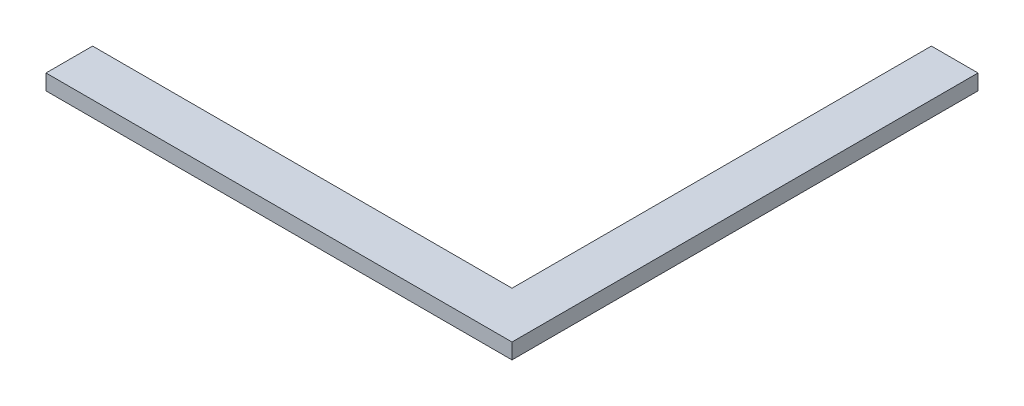
ISO-10303-21;
HEADER;
FILE_DESCRIPTION(('STEP AP214'),'2;1');
FILE_NAME('part.step','',(''),(''),'','','');
FILE_SCHEMA(('AUTOMOTIVE_DESIGN { 1 0 10303 214 1 1 1 1 }'));
ENDSEC;
DATA;
#1=APPLICATION_CONTEXT('core data for automotive mechanical design processes');
#2=APPLICATION_PROTOCOL_DEFINITION('international standard','automotive_design',2000,#1);
#3=PRODUCT_CONTEXT('',#1,'mechanical');
#4=PRODUCT('Part','Part','',(#3));
#5=PRODUCT_RELATED_PRODUCT_CATEGORY('part','',(#4));
#6=PRODUCT_DEFINITION_FORMATION('','',#4);
#7=PRODUCT_DEFINITION_CONTEXT('part definition',#1,'design');
#8=PRODUCT_DEFINITION('design','',#6,#7);
#9=PRODUCT_DEFINITION_SHAPE('','',#8);
#10=(LENGTH_UNIT() NAMED_UNIT(*) SI_UNIT(.MILLI.,.METRE.));
#11=(NAMED_UNIT(*) PLANE_ANGLE_UNIT() SI_UNIT($,.RADIAN.));
#12=(NAMED_UNIT(*) SI_UNIT($,.STERADIAN.) SOLID_ANGLE_UNIT());
#13=UNCERTAINTY_MEASURE_WITH_UNIT(LENGTH_MEASURE(1.E-05),#10,'distance_accuracy_value','');
#14=(GEOMETRIC_REPRESENTATION_CONTEXT(3) GLOBAL_UNCERTAINTY_ASSIGNED_CONTEXT((#13)) GLOBAL_UNIT_ASSIGNED_CONTEXT((#10,
#11,#12)) REPRESENTATION_CONTEXT('',''));
#15=CARTESIAN_POINT('',(0.,0.,0.));
#16=DIRECTION('',(0.,0.,1.));
#17=DIRECTION('',(1.,0.,0.));
#18=AXIS2_PLACEMENT_3D('',#15,#16,#17);
#19=CARTESIAN_POINT('',(150.,10.,150.));
#20=DIRECTION('',(-1.,0.,0.));
#21=DIRECTION('',(0.,0.,1.));
#22=AXIS2_PLACEMENT_3D('',#19,#20,#21);
#23=PLANE('',#22);
#24=DIRECTION('',(0.,0.,-1.));
#25=VECTOR('',#24,1.);
#26=CARTESIAN_POINT('',(150.,0.,150.));
#27=LINE('',#26,#25);
#28=CARTESIAN_POINT('',(150.,0.,150.));
#29=VERTEX_POINT('',#28);
#30=CARTESIAN_POINT('',(150.,0.,-150.));
#31=VERTEX_POINT('',#30);
#32=EDGE_CURVE('E116',#29,#31,#27,.T.);
#33=ORIENTED_EDGE('',*,*,#32,.T.);
#34=DIRECTION('',(0.,-1.,0.));
#35=VECTOR('',#34,1.);
#36=CARTESIAN_POINT('',(150.,10.,-150.));
#37=LINE('',#36,#35);
#38=CARTESIAN_POINT('',(150.,10.,-150.));
#39=VERTEX_POINT('',#38);
#40=EDGE_CURVE('E11',#39,#31,#37,.T.);
#41=ORIENTED_EDGE('',*,*,#40,.F.);
#42=DIRECTION('',(0.,0.,-1.));
#43=VECTOR('',#42,1.);
#44=CARTESIAN_POINT('',(150.,10.,150.));
#45=LINE('',#44,#43);
#46=CARTESIAN_POINT('',(150.,10.,150.));
#47=VERTEX_POINT('',#46);
#48=EDGE_CURVE('E126',#47,#39,#45,.T.);
#49=ORIENTED_EDGE('',*,*,#48,.F.);
#50=DIRECTION('',(0.,-1.,0.));
#51=VECTOR('',#50,1.);
#52=CARTESIAN_POINT('',(150.,10.,150.));
#53=LINE('',#52,#51);
#54=EDGE_CURVE('E112',#47,#29,#53,.T.);
#55=ORIENTED_EDGE('',*,*,#54,.T.);
#56=EDGE_LOOP('',(#33,#41,#49,#55));
#57=FACE_BOUND('',#56,.T.);
#58=ADVANCED_FACE('F32',(#57),#23,.F.);
#59=CARTESIAN_POINT('',(150.,10.,-150.));
#60=DIRECTION('',(0.,0.,1.));
#61=DIRECTION('',(1.,0.,0.));
#62=AXIS2_PLACEMENT_3D('',#59,#60,#61);
#63=PLANE('',#62);
#64=DIRECTION('',(-1.,0.,0.));
#65=VECTOR('',#64,1.);
#66=CARTESIAN_POINT('',(150.,0.,-150.));
#67=LINE('',#66,#65);
#68=CARTESIAN_POINT('',(120.,0.,-150.));
#69=VERTEX_POINT('',#68);
#70=EDGE_CURVE('E119',#31,#69,#67,.T.);
#71=ORIENTED_EDGE('',*,*,#70,.T.);
#72=DIRECTION('',(0.,-1.,0.));
#73=VECTOR('',#72,1.);
#74=CARTESIAN_POINT('',(120.,10.,-150.));
#75=LINE('',#74,#73);
#76=CARTESIAN_POINT('',(120.,10.,-150.));
#77=VERTEX_POINT('',#76);
#78=EDGE_CURVE('E40',#77,#69,#75,.T.);
#79=ORIENTED_EDGE('',*,*,#78,.F.);
#80=DIRECTION('',(-1.,0.,0.));
#81=VECTOR('',#80,1.);
#82=CARTESIAN_POINT('',(150.,10.,-150.));
#83=LINE('',#82,#81);
#84=EDGE_CURVE('E85',#39,#77,#83,.T.);
#85=ORIENTED_EDGE('',*,*,#84,.F.);
#86=ORIENTED_EDGE('',*,*,#40,.T.);
#87=EDGE_LOOP('',(#71,#79,#85,#86));
#88=FACE_BOUND('',#87,.T.);
#89=ADVANCED_FACE('F150',(#88),#63,.F.);
#90=CARTESIAN_POINT('',(120.,10.,-150.));
#91=DIRECTION('',(1.,0.,0.));
#92=DIRECTION('',(0.,0.,-1.));
#93=AXIS2_PLACEMENT_3D('',#90,#91,#92);
#94=PLANE('',#93);
#95=DIRECTION('',(0.,0.,1.));
#96=VECTOR('',#95,1.);
#97=CARTESIAN_POINT('',(120.,0.,-150.));
#98=LINE('',#97,#96);
#99=CARTESIAN_POINT('',(120.,0.,120.));
#100=VERTEX_POINT('',#99);
#101=EDGE_CURVE('E121',#69,#100,#98,.T.);
#102=ORIENTED_EDGE('',*,*,#101,.T.);
#103=DIRECTION('',(0.,-1.,0.));
#104=VECTOR('',#103,1.);
#105=CARTESIAN_POINT('',(120.,10.,120.));
#106=LINE('',#105,#104);
#107=CARTESIAN_POINT('',(120.,10.,120.));
#108=VERTEX_POINT('',#107);
#109=EDGE_CURVE('E107',#108,#100,#106,.T.);
#110=ORIENTED_EDGE('',*,*,#109,.F.);
#111=DIRECTION('',(0.,0.,1.));
#112=VECTOR('',#111,1.);
#113=CARTESIAN_POINT('',(120.,10.,-150.));
#114=LINE('',#113,#112);
#115=EDGE_CURVE('E98',#77,#108,#114,.T.);
#116=ORIENTED_EDGE('',*,*,#115,.F.);
#117=ORIENTED_EDGE('',*,*,#78,.T.);
#118=EDGE_LOOP('',(#102,#110,#116,#117));
#119=FACE_BOUND('',#118,.T.);
#120=ADVANCED_FACE('F132',(#119),#94,.F.);
#121=CARTESIAN_POINT('',(120.,10.,120.));
#122=DIRECTION('',(0.,0.,1.));
#123=DIRECTION('',(1.,0.,0.));
#124=AXIS2_PLACEMENT_3D('',#121,#122,#123);
#125=PLANE('',#124);
#126=DIRECTION('',(-1.,0.,0.));
#127=VECTOR('',#126,1.);
#128=CARTESIAN_POINT('',(120.,0.,120.));
#129=LINE('',#128,#127);
#130=CARTESIAN_POINT('',(-150.,0.,120.));
#131=VERTEX_POINT('',#130);
#132=EDGE_CURVE('E106',#100,#131,#129,.T.);
#133=ORIENTED_EDGE('',*,*,#132,.T.);
#134=DIRECTION('',(0.,-1.,0.));
#135=VECTOR('',#134,1.);
#136=CARTESIAN_POINT('',(-150.,10.,120.));
#137=LINE('',#136,#135);
#138=CARTESIAN_POINT('',(-150.,10.,120.));
#139=VERTEX_POINT('',#138);
#140=EDGE_CURVE('E103',#139,#131,#137,.T.);
#141=ORIENTED_EDGE('',*,*,#140,.F.);
#142=DIRECTION('',(-1.,0.,0.));
#143=VECTOR('',#142,1.);
#144=CARTESIAN_POINT('',(120.,10.,120.));
#145=LINE('',#144,#143);
#146=EDGE_CURVE('E92',#108,#139,#145,.T.);
#147=ORIENTED_EDGE('',*,*,#146,.F.);
#148=ORIENTED_EDGE('',*,*,#109,.T.);
#149=EDGE_LOOP('',(#133,#141,#147,#148));
#150=FACE_BOUND('',#149,.T.);
#151=ADVANCED_FACE('F104',(#150),#125,.F.);
#152=CARTESIAN_POINT('',(-150.,10.,120.));
#153=DIRECTION('',(1.,0.,0.));
#154=DIRECTION('',(0.,0.,-1.));
#155=AXIS2_PLACEMENT_3D('',#152,#153,#154);
#156=PLANE('',#155);
#157=DIRECTION('',(0.,0.,1.));
#158=VECTOR('',#157,1.);
#159=CARTESIAN_POINT('',(-150.,0.,120.));
#160=LINE('',#159,#158);
#161=CARTESIAN_POINT('',(-150.,0.,150.));
#162=VERTEX_POINT('',#161);
#163=EDGE_CURVE('E71',#131,#162,#160,.T.);
#164=ORIENTED_EDGE('',*,*,#163,.T.);
#165=DIRECTION('',(0.,-1.,0.));
#166=VECTOR('',#165,1.);
#167=CARTESIAN_POINT('',(-150.,10.,150.));
#168=LINE('',#167,#166);
#169=CARTESIAN_POINT('',(-150.,10.,150.));
#170=VERTEX_POINT('',#169);
#171=EDGE_CURVE('E108',#170,#162,#168,.T.);
#172=ORIENTED_EDGE('',*,*,#171,.F.);
#173=DIRECTION('',(0.,0.,1.));
#174=VECTOR('',#173,1.);
#175=CARTESIAN_POINT('',(-150.,10.,120.));
#176=LINE('',#175,#174);
#177=EDGE_CURVE('E96',#139,#170,#176,.T.);
#178=ORIENTED_EDGE('',*,*,#177,.F.);
#179=ORIENTED_EDGE('',*,*,#140,.T.);
#180=EDGE_LOOP('',(#164,#172,#178,#179));
#181=FACE_BOUND('',#180,.T.);
#182=ADVANCED_FACE('F110',(#181),#156,.F.);
#183=CARTESIAN_POINT('',(-150.,10.,150.));
#184=DIRECTION('',(0.,0.,-1.));
#185=DIRECTION('',(-1.,0.,0.));
#186=AXIS2_PLACEMENT_3D('',#183,#184,#185);
#187=PLANE('',#186);
#188=DIRECTION('',(1.,0.,0.));
#189=VECTOR('',#188,1.);
#190=CARTESIAN_POINT('',(-150.,0.,150.));
#191=LINE('',#190,#189);
#192=EDGE_CURVE('E77',#162,#29,#191,.T.);
#193=ORIENTED_EDGE('',*,*,#192,.T.);
#194=ORIENTED_EDGE('',*,*,#54,.F.);
#195=DIRECTION('',(1.,0.,0.));
#196=VECTOR('',#195,1.);
#197=CARTESIAN_POINT('',(-150.,10.,150.));
#198=LINE('',#197,#196);
#199=EDGE_CURVE('E48',#170,#47,#198,.T.);
#200=ORIENTED_EDGE('',*,*,#199,.F.);
#201=ORIENTED_EDGE('',*,*,#171,.T.);
#202=EDGE_LOOP('',(#193,#194,#200,#201));
#203=FACE_BOUND('',#202,.T.);
#204=ADVANCED_FACE('F139',(#203),#187,.F.);
#205=CARTESIAN_POINT('',(0.,10.,0.));
#206=DIRECTION('',(0.,1.,0.));
#207=DIRECTION('',(0.,0.,1.));
#208=AXIS2_PLACEMENT_3D('',#205,#206,#207);
#209=PLANE('',#208);
#210=ORIENTED_EDGE('',*,*,#48,.T.);
#211=ORIENTED_EDGE('',*,*,#84,.T.);
#212=ORIENTED_EDGE('',*,*,#115,.T.);
#213=ORIENTED_EDGE('',*,*,#146,.T.);
#214=ORIENTED_EDGE('',*,*,#177,.T.);
#215=ORIENTED_EDGE('',*,*,#199,.T.);
#216=EDGE_LOOP('',(#210,#211,#212,#213,#214,#215));
#217=FACE_BOUND('',#216,.T.);
#218=ADVANCED_FACE('F94',(#217),#209,.T.);
#219=CARTESIAN_POINT('',(0.,0.,0.));
#220=DIRECTION('',(0.,1.,0.));
#221=DIRECTION('',(0.,0.,1.));
#222=AXIS2_PLACEMENT_3D('',#219,#220,#221);
#223=PLANE('',#222);
#224=ORIENTED_EDGE('',*,*,#32,.F.);
#225=ORIENTED_EDGE('',*,*,#192,.F.);
#226=ORIENTED_EDGE('',*,*,#163,.F.);
#227=ORIENTED_EDGE('',*,*,#132,.F.);
#228=ORIENTED_EDGE('',*,*,#101,.F.);
#229=ORIENTED_EDGE('',*,*,#70,.F.);
#230=EDGE_LOOP('',(#224,#225,#226,#227,#228,#229));
#231=FACE_BOUND('',#230,.T.);
#232=ADVANCED_FACE('F135',(#231),#223,.F.);
#233=CLOSED_SHELL('',(#58,#89,#120,#151,#182,#204,#218,#232));
#234=MANIFOLD_SOLID_BREP('B2',#233);
#235=ADVANCED_BREP_SHAPE_REPRESENTATION('',(#18,#234),#14);
#236=SHAPE_DEFINITION_REPRESENTATION(#9,#235);
ENDSEC;
END-ISO-10303-21;
